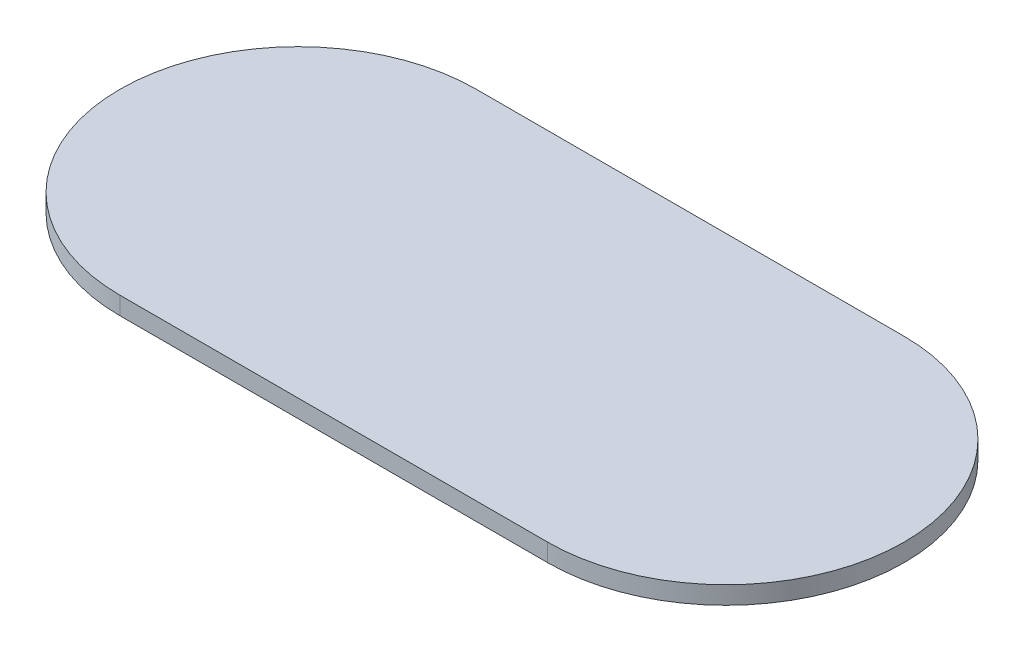
ISO-10303-21;
HEADER;
FILE_DESCRIPTION(('STEP AP214'),'2;1');
FILE_NAME('part.step','',(''),(''),'','','');
FILE_SCHEMA(('AUTOMOTIVE_DESIGN { 1 0 10303 214 1 1 1 1 }'));
ENDSEC;
DATA;
#1=APPLICATION_CONTEXT('core data for automotive mechanical design processes');
#2=APPLICATION_PROTOCOL_DEFINITION('international standard','automotive_design',2000,#1);
#3=PRODUCT_CONTEXT('',#1,'mechanical');
#4=PRODUCT('Part','Part','',(#3));
#5=PRODUCT_RELATED_PRODUCT_CATEGORY('part','',(#4));
#6=PRODUCT_DEFINITION_FORMATION('','',#4);
#7=PRODUCT_DEFINITION_CONTEXT('part definition',#1,'design');
#8=PRODUCT_DEFINITION('design','',#6,#7);
#9=PRODUCT_DEFINITION_SHAPE('','',#8);
#10=(LENGTH_UNIT() NAMED_UNIT(*) SI_UNIT(.MILLI.,.METRE.));
#11=(NAMED_UNIT(*) PLANE_ANGLE_UNIT() SI_UNIT($,.RADIAN.));
#12=(NAMED_UNIT(*) SI_UNIT($,.STERADIAN.) SOLID_ANGLE_UNIT());
#13=UNCERTAINTY_MEASURE_WITH_UNIT(LENGTH_MEASURE(1.E-05),#10,'distance_accuracy_value','');
#14=(GEOMETRIC_REPRESENTATION_CONTEXT(3) GLOBAL_UNCERTAINTY_ASSIGNED_CONTEXT((#13)) GLOBAL_UNIT_ASSIGNED_CONTEXT((#10,
#11,#12)) REPRESENTATION_CONTEXT('',''));
#15=CARTESIAN_POINT('',(0.,0.,0.));
#16=DIRECTION('',(0.,0.,1.));
#17=DIRECTION('',(1.,0.,0.));
#18=AXIS2_PLACEMENT_3D('',#15,#16,#17);
#19=CARTESIAN_POINT('',(-76.2,6.35,63.5));
#20=DIRECTION('',(0.,-1.,0.));
#21=DIRECTION('',(0.,0.,-1.));
#22=AXIS2_PLACEMENT_3D('',#19,#20,#21);
#23=CYLINDRICAL_SURFACE('',#22,63.5);
#24=CARTESIAN_POINT('',(-76.2,0.,63.5));
#25=DIRECTION('',(0.,1.,0.));
#26=DIRECTION('',(0.,0.,1.));
#27=AXIS2_PLACEMENT_3D('',#24,#25,#26);
#28=CIRCLE('',#27,63.5);
#29=CARTESIAN_POINT('',(-76.2,0.,0.));
#30=VERTEX_POINT('',#29);
#31=CARTESIAN_POINT('',(-76.2,0.,127.));
#32=VERTEX_POINT('',#31);
#33=EDGE_CURVE('E95',#30,#32,#28,.T.);
#34=ORIENTED_EDGE('',*,*,#33,.T.);
#35=DIRECTION('',(0.,-1.,0.));
#36=VECTOR('',#35,1.);
#37=CARTESIAN_POINT('',(-76.2,6.35,127.));
#38=LINE('',#37,#36);
#39=CARTESIAN_POINT('',(-76.2,6.35,127.));
#40=VERTEX_POINT('',#39);
#41=EDGE_CURVE('E11',#40,#32,#38,.T.);
#42=ORIENTED_EDGE('',*,*,#41,.F.);
#43=CARTESIAN_POINT('',(-76.2,6.35,63.5));
#44=DIRECTION('',(0.,1.,0.));
#45=DIRECTION('',(0.,0.,1.));
#46=AXIS2_PLACEMENT_3D('',#43,#44,#45);
#47=CIRCLE('',#46,63.5);
#48=CARTESIAN_POINT('',(-76.2,6.35,0.));
#49=VERTEX_POINT('',#48);
#50=EDGE_CURVE('E83',#49,#40,#47,.T.);
#51=ORIENTED_EDGE('',*,*,#50,.F.);
#52=DIRECTION('',(0.,-1.,0.));
#53=VECTOR('',#52,1.);
#54=CARTESIAN_POINT('',(-76.2,6.35,0.));
#55=LINE('',#54,#53);
#56=EDGE_CURVE('E91',#49,#30,#55,.T.);
#57=ORIENTED_EDGE('',*,*,#56,.T.);
#58=EDGE_LOOP('',(#34,#42,#51,#57));
#59=FACE_BOUND('',#58,.T.);
#60=ADVANCED_FACE('F32',(#59),#23,.T.);
#61=CARTESIAN_POINT('',(-76.2,6.35,127.));
#62=DIRECTION('',(0.,0.,-1.));
#63=DIRECTION('',(-1.,0.,0.));
#64=AXIS2_PLACEMENT_3D('',#61,#62,#63);
#65=PLANE('',#64);
#66=DIRECTION('',(1.,0.,0.));
#67=VECTOR('',#66,1.);
#68=CARTESIAN_POINT('',(-76.2,0.,127.));
#69=LINE('',#68,#67);
#70=CARTESIAN_POINT('',(76.2,0.,127.));
#71=VERTEX_POINT('',#70);
#72=EDGE_CURVE('E87',#32,#71,#69,.T.);
#73=ORIENTED_EDGE('',*,*,#72,.T.);
#74=DIRECTION('',(0.,-1.,0.));
#75=VECTOR('',#74,1.);
#76=CARTESIAN_POINT('',(76.2,6.35,127.));
#77=LINE('',#76,#75);
#78=CARTESIAN_POINT('',(76.2,6.35,127.));
#79=VERTEX_POINT('',#78);
#80=EDGE_CURVE('E40',#79,#71,#77,.T.);
#81=ORIENTED_EDGE('',*,*,#80,.F.);
#82=DIRECTION('',(1.,0.,0.));
#83=VECTOR('',#82,1.);
#84=CARTESIAN_POINT('',(-76.2,6.35,127.));
#85=LINE('',#84,#83);
#86=EDGE_CURVE('E78',#40,#79,#85,.T.);
#87=ORIENTED_EDGE('',*,*,#86,.F.);
#88=ORIENTED_EDGE('',*,*,#41,.T.);
#89=EDGE_LOOP('',(#73,#81,#87,#88));
#90=FACE_BOUND('',#89,.T.);
#91=ADVANCED_FACE('F86',(#90),#65,.F.);
#92=CARTESIAN_POINT('',(76.2,6.35,63.5));
#93=DIRECTION('',(0.,-1.,0.));
#94=DIRECTION('',(0.,0.,-1.));
#95=AXIS2_PLACEMENT_3D('',#92,#93,#94);
#96=CYLINDRICAL_SURFACE('',#95,63.5);
#97=CARTESIAN_POINT('',(76.2,0.,63.5));
#98=DIRECTION('',(0.,1.,0.));
#99=DIRECTION('',(0.,0.,-1.));
#100=AXIS2_PLACEMENT_3D('',#97,#98,#99);
#101=CIRCLE('',#100,63.5);
#102=CARTESIAN_POINT('',(76.2,0.,0.));
#103=VERTEX_POINT('',#102);
#104=EDGE_CURVE('E65',#71,#103,#101,.T.);
#105=ORIENTED_EDGE('',*,*,#104,.T.);
#106=DIRECTION('',(0.,-1.,0.));
#107=VECTOR('',#106,1.);
#108=CARTESIAN_POINT('',(76.2,6.35,0.));
#109=LINE('',#108,#107);
#110=CARTESIAN_POINT('',(76.2,6.35,0.));
#111=VERTEX_POINT('',#110);
#112=EDGE_CURVE('E88',#111,#103,#109,.T.);
#113=ORIENTED_EDGE('',*,*,#112,.F.);
#114=CARTESIAN_POINT('',(76.2,6.35,63.5));
#115=DIRECTION('',(0.,1.,0.));
#116=DIRECTION('',(0.,0.,-1.));
#117=AXIS2_PLACEMENT_3D('',#114,#115,#116);
#118=CIRCLE('',#117,63.5);
#119=EDGE_CURVE('E81',#79,#111,#118,.T.);
#120=ORIENTED_EDGE('',*,*,#119,.F.);
#121=ORIENTED_EDGE('',*,*,#80,.T.);
#122=EDGE_LOOP('',(#105,#113,#120,#121));
#123=FACE_BOUND('',#122,.T.);
#124=ADVANCED_FACE('F89',(#123),#96,.T.);
#125=CARTESIAN_POINT('',(-76.2,6.35,0.));
#126=DIRECTION('',(0.,0.,1.));
#127=DIRECTION('',(1.,0.,0.));
#128=AXIS2_PLACEMENT_3D('',#125,#126,#127);
#129=PLANE('',#128);
#130=DIRECTION('',(-1.,0.,0.));
#131=VECTOR('',#130,1.);
#132=CARTESIAN_POINT('',(-76.2,0.,0.));
#133=LINE('',#132,#131);
#134=EDGE_CURVE('E71',#103,#30,#133,.T.);
#135=ORIENTED_EDGE('',*,*,#134,.T.);
#136=ORIENTED_EDGE('',*,*,#56,.F.);
#137=DIRECTION('',(-1.,0.,0.));
#138=VECTOR('',#137,1.);
#139=CARTESIAN_POINT('',(-76.2,6.35,0.));
#140=LINE('',#139,#138);
#141=EDGE_CURVE('E48',#111,#49,#140,.T.);
#142=ORIENTED_EDGE('',*,*,#141,.F.);
#143=ORIENTED_EDGE('',*,*,#112,.T.);
#144=EDGE_LOOP('',(#135,#136,#142,#143));
#145=FACE_BOUND('',#144,.T.);
#146=ADVANCED_FACE('F102',(#145),#129,.F.);
#147=CARTESIAN_POINT('',(-76.2,6.35,63.5));
#148=DIRECTION('',(0.,1.,0.));
#149=DIRECTION('',(0.,0.,1.));
#150=AXIS2_PLACEMENT_3D('',#147,#148,#149);
#151=PLANE('',#150);
#152=ORIENTED_EDGE('',*,*,#50,.T.);
#153=ORIENTED_EDGE('',*,*,#86,.T.);
#154=ORIENTED_EDGE('',*,*,#119,.T.);
#155=ORIENTED_EDGE('',*,*,#141,.T.);
#156=EDGE_LOOP('',(#152,#153,#154,#155));
#157=FACE_BOUND('',#156,.T.);
#158=ADVANCED_FACE('F79',(#157),#151,.T.);
#159=CARTESIAN_POINT('',(-76.2,0.,63.5));
#160=DIRECTION('',(0.,1.,0.));
#161=DIRECTION('',(0.,0.,1.));
#162=AXIS2_PLACEMENT_3D('',#159,#160,#161);
#163=PLANE('',#162);
#164=ORIENTED_EDGE('',*,*,#33,.F.);
#165=ORIENTED_EDGE('',*,*,#134,.F.);
#166=ORIENTED_EDGE('',*,*,#104,.F.);
#167=ORIENTED_EDGE('',*,*,#72,.F.);
#168=EDGE_LOOP('',(#164,#165,#166,#167));
#169=FACE_BOUND('',#168,.T.);
#170=ADVANCED_FACE('F105',(#169),#163,.F.);
#171=CLOSED_SHELL('',(#60,#91,#124,#146,#158,#170));
#172=MANIFOLD_SOLID_BREP('B2',#171);
#173=ADVANCED_BREP_SHAPE_REPRESENTATION('',(#18,#172),#14);
#174=SHAPE_DEFINITION_REPRESENTATION(#9,#173);
ENDSEC;
END-ISO-10303-21;
